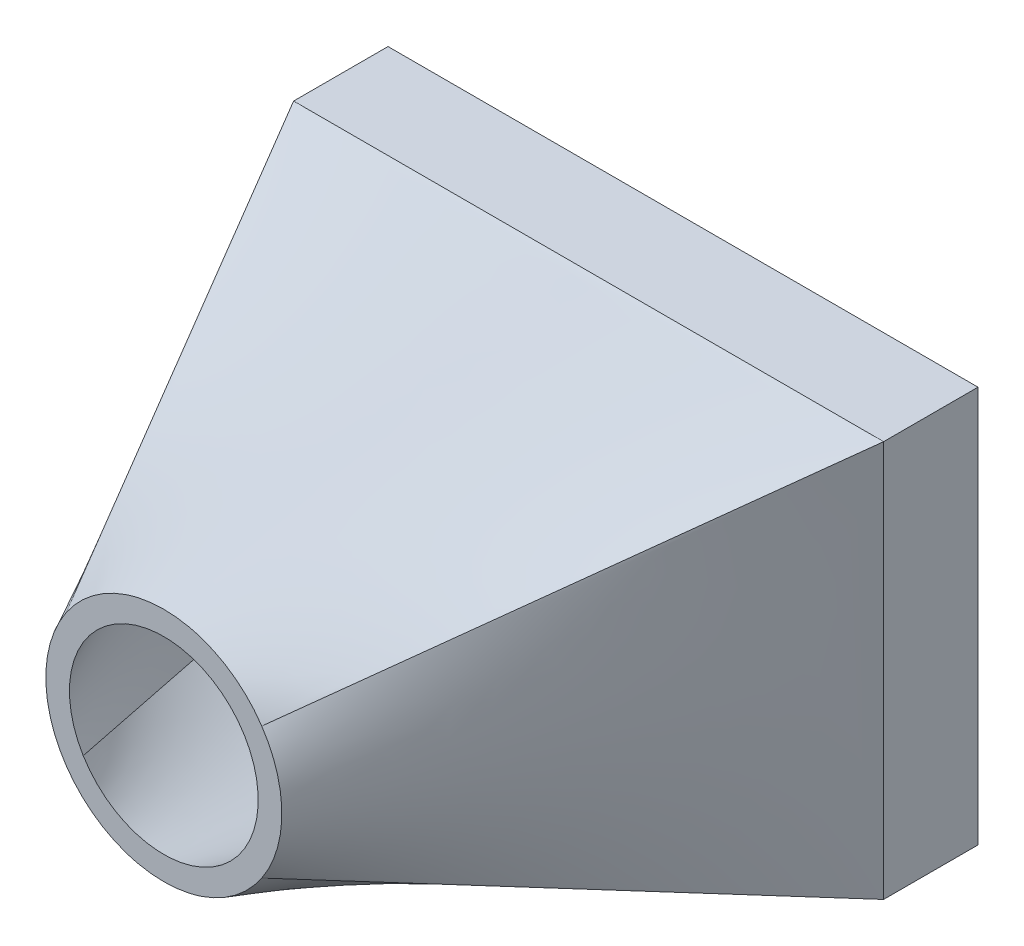
ISO-10303-21;
HEADER;
FILE_DESCRIPTION(('STEP AP214'),'2;1');
FILE_NAME('part.step','',(''),(''),'','','');
FILE_SCHEMA(('AUTOMOTIVE_DESIGN { 1 0 10303 214 1 1 1 1 }'));
ENDSEC;
DATA;
#1=APPLICATION_CONTEXT('core data for automotive mechanical design processes');
#2=APPLICATION_PROTOCOL_DEFINITION('international standard','automotive_design',2000,#1);
#3=PRODUCT_CONTEXT('',#1,'mechanical');
#4=PRODUCT('Part','Part','',(#3));
#5=PRODUCT_RELATED_PRODUCT_CATEGORY('part','',(#4));
#6=PRODUCT_DEFINITION_FORMATION('','',#4);
#7=PRODUCT_DEFINITION_CONTEXT('part definition',#1,'design');
#8=PRODUCT_DEFINITION('design','',#6,#7);
#9=PRODUCT_DEFINITION_SHAPE('','',#8);
#10=(LENGTH_UNIT() NAMED_UNIT(*) SI_UNIT(.MILLI.,.METRE.));
#11=(NAMED_UNIT(*) PLANE_ANGLE_UNIT() SI_UNIT($,.RADIAN.));
#12=(NAMED_UNIT(*) SI_UNIT($,.STERADIAN.) SOLID_ANGLE_UNIT());
#13=UNCERTAINTY_MEASURE_WITH_UNIT(LENGTH_MEASURE(1.E-05),#10,'distance_accuracy_value','');
#14=(GEOMETRIC_REPRESENTATION_CONTEXT(3) GLOBAL_UNCERTAINTY_ASSIGNED_CONTEXT((#13)) GLOBAL_UNIT_ASSIGNED_CONTEXT((#10,
#11,#12)) REPRESENTATION_CONTEXT('',''));
#15=CARTESIAN_POINT('',(0.,0.,0.));
#16=DIRECTION('',(0.,0.,1.));
#17=DIRECTION('',(1.,0.,0.));
#18=AXIS2_PLACEMENT_3D('',#15,#16,#17);
#19=CARTESIAN_POINT('',(-6.25,-4.2,1.));
#20=DIRECTION('',(0.,1.,0.));
#21=DIRECTION('',(0.,0.,1.));
#22=AXIS2_PLACEMENT_3D('',#19,#20,#21);
#23=PLANE('',#22);
#24=DIRECTION('',(0.,0.,-1.));
#25=VECTOR('',#24,1.);
#26=CARTESIAN_POINT('',(-6.25,-4.2,1.));
#27=LINE('',#26,#25);
#28=CARTESIAN_POINT('',(-6.25,-4.2,1.));
#29=VERTEX_POINT('',#28);
#30=CARTESIAN_POINT('',(-6.25,-4.2,-1.));
#31=VERTEX_POINT('',#30);
#32=EDGE_CURVE('E550',#29,#31,#27,.T.);
#33=ORIENTED_EDGE('',*,*,#32,.T.);
#34=DIRECTION('',(-1.,0.,0.));
#35=VECTOR('',#34,1.);
#36=CARTESIAN_POINT('',(6.25,-4.2,-1.));
#37=LINE('',#36,#35);
#38=CARTESIAN_POINT('',(6.25,-4.2,-1.));
#39=VERTEX_POINT('',#38);
#40=EDGE_CURVE('E226',#39,#31,#37,.T.);
#41=ORIENTED_EDGE('',*,*,#40,.F.);
#42=DIRECTION('',(0.,0.,-1.));
#43=VECTOR('',#42,1.);
#44=CARTESIAN_POINT('',(6.25,-4.2,1.));
#45=LINE('',#44,#43);
#46=CARTESIAN_POINT('',(6.25,-4.2,1.));
#47=VERTEX_POINT('',#46);
#48=EDGE_CURVE('E12',#47,#39,#45,.T.);
#49=ORIENTED_EDGE('',*,*,#48,.F.);
#50=DIRECTION('',(1.,0.,0.));
#51=VECTOR('',#50,1.);
#52=CARTESIAN_POINT('',(-6.25,-4.2,1.));
#53=LINE('',#52,#51);
#54=EDGE_CURVE('E295',#29,#47,#53,.T.);
#55=ORIENTED_EDGE('',*,*,#54,.F.);
#56=EDGE_LOOP('',(#33,#41,#49,#55));
#57=FACE_BOUND('',#56,.T.);
#58=ADVANCED_FACE('F97',(#57),#23,.F.);
#59=CARTESIAN_POINT('',(6.25,-4.2,1.));
#60=DIRECTION('',(-1.,0.,0.));
#61=DIRECTION('',(0.,0.,1.));
#62=AXIS2_PLACEMENT_3D('',#59,#60,#61);
#63=PLANE('',#62);
#64=ORIENTED_EDGE('',*,*,#48,.T.);
#65=DIRECTION('',(0.,-1.,0.));
#66=VECTOR('',#65,1.);
#67=CARTESIAN_POINT('',(6.25,4.2,-1.));
#68=LINE('',#67,#66);
#69=CARTESIAN_POINT('',(6.25,4.2,-1.));
#70=VERTEX_POINT('',#69);
#71=EDGE_CURVE('E219',#70,#39,#68,.T.);
#72=ORIENTED_EDGE('',*,*,#71,.F.);
#73=DIRECTION('',(0.,0.,-1.));
#74=VECTOR('',#73,1.);
#75=CARTESIAN_POINT('',(6.25,4.2,1.));
#76=LINE('',#75,#74);
#77=CARTESIAN_POINT('',(6.25,4.2,0.999999999999999));
#78=VERTEX_POINT('',#77);
#79=EDGE_CURVE('E108',#78,#70,#76,.T.);
#80=ORIENTED_EDGE('',*,*,#79,.F.);
#81=DIRECTION('',(0.,1.,0.));
#82=VECTOR('',#81,1.);
#83=CARTESIAN_POINT('',(6.25,-4.2,1.));
#84=LINE('',#83,#82);
#85=EDGE_CURVE('E573',#47,#78,#84,.T.);
#86=ORIENTED_EDGE('',*,*,#85,.F.);
#87=EDGE_LOOP('',(#64,#72,#80,#86));
#88=FACE_BOUND('',#87,.T.);
#89=ADVANCED_FACE('F540',(#88),#63,.F.);
#90=CARTESIAN_POINT('',(-6.25,4.2,1.));
#91=DIRECTION('',(0.,-1.,0.));
#92=DIRECTION('',(0.,0.,-1.));
#93=AXIS2_PLACEMENT_3D('',#90,#91,#92);
#94=PLANE('',#93);
#95=ORIENTED_EDGE('',*,*,#79,.T.);
#96=DIRECTION('',(1.,0.,0.));
#97=VECTOR('',#96,1.);
#98=CARTESIAN_POINT('',(-6.25,4.2,-1.));
#99=LINE('',#98,#97);
#100=CARTESIAN_POINT('',(-6.25,4.2,-1.));
#101=VERTEX_POINT('',#100);
#102=EDGE_CURVE('E234',#101,#70,#99,.T.);
#103=ORIENTED_EDGE('',*,*,#102,.F.);
#104=DIRECTION('',(0.,0.,-1.));
#105=VECTOR('',#104,1.);
#106=CARTESIAN_POINT('',(-6.25,4.2,1.));
#107=LINE('',#106,#105);
#108=CARTESIAN_POINT('',(-6.25,4.2,1.));
#109=VERTEX_POINT('',#108);
#110=EDGE_CURVE('E558',#109,#101,#107,.T.);
#111=ORIENTED_EDGE('',*,*,#110,.F.);
#112=DIRECTION('',(1.,0.,0.));
#113=VECTOR('',#112,1.);
#114=CARTESIAN_POINT('',(-6.25,4.2,1.));
#115=LINE('',#114,#113);
#116=EDGE_CURVE('E576',#78,#109,#115,.F.);
#117=ORIENTED_EDGE('',*,*,#116,.F.);
#118=EDGE_LOOP('',(#95,#103,#111,#117));
#119=FACE_BOUND('',#118,.T.);
#120=ADVANCED_FACE('F546',(#119),#94,.F.);
#121=CARTESIAN_POINT('',(-6.25,-4.2,1.));
#122=DIRECTION('',(1.,0.,0.));
#123=DIRECTION('',(0.,0.,-1.));
#124=AXIS2_PLACEMENT_3D('',#121,#122,#123);
#125=PLANE('',#124);
#126=ORIENTED_EDGE('',*,*,#110,.T.);
#127=DIRECTION('',(0.,1.,0.));
#128=VECTOR('',#127,1.);
#129=CARTESIAN_POINT('',(-6.25,-4.2,-1.));
#130=LINE('',#129,#128);
#131=EDGE_CURVE('E230',#31,#101,#130,.T.);
#132=ORIENTED_EDGE('',*,*,#131,.F.);
#133=ORIENTED_EDGE('',*,*,#32,.F.);
#134=DIRECTION('',(0.,1.,0.));
#135=VECTOR('',#134,1.);
#136=CARTESIAN_POINT('',(-6.25,-4.2,1.));
#137=LINE('',#136,#135);
#138=EDGE_CURVE('E559',#109,#29,#137,.F.);
#139=ORIENTED_EDGE('',*,*,#138,.F.);
#140=EDGE_LOOP('',(#126,#132,#133,#139));
#141=FACE_BOUND('',#140,.T.);
#142=ADVANCED_FACE('F562',(#141),#125,.F.);
#143=CARTESIAN_POINT('',(5.25,-3.2,1.));
#144=DIRECTION('',(-1.,0.,0.));
#145=DIRECTION('',(0.,0.,1.));
#146=AXIS2_PLACEMENT_3D('',#143,#144,#145);
#147=PLANE('',#146);
#148=DIRECTION('',(0.,0.,-1.));
#149=VECTOR('',#148,1.);
#150=CARTESIAN_POINT('',(5.25,3.2,1.));
#151=LINE('',#150,#149);
#152=CARTESIAN_POINT('',(5.25,3.2,1.));
#153=VERTEX_POINT('',#152);
#154=CARTESIAN_POINT('',(5.25,3.2,-1.));
#155=VERTEX_POINT('',#154);
#156=EDGE_CURVE('E287',#153,#155,#151,.T.);
#157=ORIENTED_EDGE('',*,*,#156,.T.);
#158=DIRECTION('',(0.,-1.,0.));
#159=VECTOR('',#158,1.);
#160=CARTESIAN_POINT('',(5.25,3.2,-1.));
#161=LINE('',#160,#159);
#162=CARTESIAN_POINT('',(5.25,-3.2,-1.));
#163=VERTEX_POINT('',#162);
#164=EDGE_CURVE('E210',#155,#163,#161,.T.);
#165=ORIENTED_EDGE('',*,*,#164,.T.);
#166=DIRECTION('',(0.,0.,-1.));
#167=VECTOR('',#166,1.);
#168=CARTESIAN_POINT('',(5.25,-3.2,1.));
#169=LINE('',#168,#167);
#170=CARTESIAN_POINT('',(5.25,-3.2,1.));
#171=VERTEX_POINT('',#170);
#172=EDGE_CURVE('E116',#171,#163,#169,.T.);
#173=ORIENTED_EDGE('',*,*,#172,.F.);
#174=CARTESIAN_POINT('',(5.25,3.2,1.));
#175=CARTESIAN_POINT('',(5.25,2.66666666666667,1.));
#176=CARTESIAN_POINT('',(5.25,2.13333333333333,1.));
#177=CARTESIAN_POINT('',(5.25,1.06666666666667,1.));
#178=CARTESIAN_POINT('',(5.25,0.533333333333335,1.));
#179=CARTESIAN_POINT('',(5.25,-0.533333333333332,1.));
#180=CARTESIAN_POINT('',(5.25,-1.06666666666666,1.));
#181=CARTESIAN_POINT('',(5.25,-2.13333333333333,1.));
#182=CARTESIAN_POINT('',(5.25,-2.66666666666667,1.));
#183=CARTESIAN_POINT('',(5.25,-3.2,1.));
#184=B_SPLINE_CURVE_WITH_KNOTS('',3,(#174,#175,#176,#177,#178,#179,#180,#181,#182,#183),
.UNSPECIFIED.,.F.,.F.,(4,2,2,2,4),(0.,0.25,0.5,0.75,1.),.UNSPECIFIED.);
#185=EDGE_CURVE('E302',#171,#153,#184,.F.);
#186=ORIENTED_EDGE('',*,*,#185,.T.);
#187=EDGE_LOOP('',(#157,#165,#173,#186));
#188=FACE_BOUND('',#187,.T.);
#189=ADVANCED_FACE('F277',(#188),#147,.T.);
#190=CARTESIAN_POINT('',(-5.25,3.2,1.));
#191=DIRECTION('',(0.,-1.,0.));
#192=DIRECTION('',(0.,0.,-1.));
#193=AXIS2_PLACEMENT_3D('',#190,#191,#192);
#194=PLANE('',#193);
#195=DIRECTION('',(0.,0.,-1.));
#196=VECTOR('',#195,1.);
#197=CARTESIAN_POINT('',(-5.25,3.2,1.));
#198=LINE('',#197,#196);
#199=CARTESIAN_POINT('',(-5.25,3.2,1.));
#200=VERTEX_POINT('',#199);
#201=CARTESIAN_POINT('',(-5.25,3.2,-1.));
#202=VERTEX_POINT('',#201);
#203=EDGE_CURVE('E202',#200,#202,#198,.T.);
#204=ORIENTED_EDGE('',*,*,#203,.T.);
#205=DIRECTION('',(1.,0.,0.));
#206=VECTOR('',#205,1.);
#207=CARTESIAN_POINT('',(-5.25,3.2,-1.));
#208=LINE('',#207,#206);
#209=EDGE_CURVE('E215',#202,#155,#208,.T.);
#210=ORIENTED_EDGE('',*,*,#209,.T.);
#211=ORIENTED_EDGE('',*,*,#156,.F.);
#212=CARTESIAN_POINT('',(-5.25,3.2,1.));
#213=CARTESIAN_POINT('',(-4.8125,3.2,1.));
#214=CARTESIAN_POINT('',(-4.375,3.2,1.));
#215=CARTESIAN_POINT('',(-3.5,3.2,1.));
#216=CARTESIAN_POINT('',(-3.0625,3.2,1.));
#217=CARTESIAN_POINT('',(-2.1875,3.2,1.));
#218=CARTESIAN_POINT('',(-1.75,3.2,1.));
#219=CARTESIAN_POINT('',(-0.874999999999995,3.2,1.));
#220=CARTESIAN_POINT('',(-0.437499999999995,3.2,1.));
#221=CARTESIAN_POINT('',(0.437500000000005,3.2,1.));
#222=CARTESIAN_POINT('',(0.875000000000004,3.2,1.));
#223=CARTESIAN_POINT('',(1.75,3.2,1.));
#224=CARTESIAN_POINT('',(2.1875,3.2,1.));
#225=CARTESIAN_POINT('',(3.0625,3.2,1.));
#226=CARTESIAN_POINT('',(3.5,3.2,1.));
#227=CARTESIAN_POINT('',(4.375,3.2,1.));
#228=CARTESIAN_POINT('',(4.8125,3.2,1.));
#229=CARTESIAN_POINT('',(5.25,3.2,1.));
#230=B_SPLINE_CURVE_WITH_KNOTS('',3,(#212,#213,#214,#215,#216,#217,#218,#219,#220,#221,#222,
#223,#224,#225,#226,#227,#228,#229),.UNSPECIFIED.,.F.,.F.,(4,2,2,2,2,2,2,2,4),(0.,0.125,0.25,
0.375,0.5,0.625,0.75,0.875,1.),.UNSPECIFIED.);
#231=EDGE_CURVE('E322',#153,#200,#230,.F.);
#232=ORIENTED_EDGE('',*,*,#231,.T.);
#233=EDGE_LOOP('',(#204,#210,#211,#232));
#234=FACE_BOUND('',#233,.T.);
#235=ADVANCED_FACE('F271',(#234),#194,.T.);
#236=CARTESIAN_POINT('',(-5.25,-3.2,1.));
#237=DIRECTION('',(1.,0.,0.));
#238=DIRECTION('',(0.,0.,-1.));
#239=AXIS2_PLACEMENT_3D('',#236,#237,#238);
#240=PLANE('',#239);
#241=DIRECTION('',(0.,0.,-1.));
#242=VECTOR('',#241,1.);
#243=CARTESIAN_POINT('',(-5.25,-3.2,1.));
#244=LINE('',#243,#242);
#245=CARTESIAN_POINT('',(-5.25,-3.2,1.));
#246=VERTEX_POINT('',#245);
#247=CARTESIAN_POINT('',(-5.25,-3.2,-1.));
#248=VERTEX_POINT('',#247);
#249=EDGE_CURVE('E193',#246,#248,#244,.T.);
#250=ORIENTED_EDGE('',*,*,#249,.T.);
#251=DIRECTION('',(0.,1.,0.));
#252=VECTOR('',#251,1.);
#253=CARTESIAN_POINT('',(-5.25,-3.2,-1.));
#254=LINE('',#253,#252);
#255=EDGE_CURVE('E197',#248,#202,#254,.T.);
#256=ORIENTED_EDGE('',*,*,#255,.T.);
#257=ORIENTED_EDGE('',*,*,#203,.F.);
#258=CARTESIAN_POINT('',(-5.25,-3.2,1.));
#259=CARTESIAN_POINT('',(-5.25,-2.66666666666667,1.));
#260=CARTESIAN_POINT('',(-5.25,-2.13333333333334,1.));
#261=CARTESIAN_POINT('',(-5.25,-1.06666666666668,1.));
#262=CARTESIAN_POINT('',(-5.25,-0.533333333333351,1.));
#263=CARTESIAN_POINT('',(-5.25,0.533333333333316,1.));
#264=CARTESIAN_POINT('',(-5.25,1.06666666666665,1.));
#265=CARTESIAN_POINT('',(-5.25,2.13333333333332,1.));
#266=CARTESIAN_POINT('',(-5.25,2.66666666666666,1.));
#267=CARTESIAN_POINT('',(-5.25,3.2,1.));
#268=B_SPLINE_CURVE_WITH_KNOTS('',3,(#258,#259,#260,#261,#262,#263,#264,#265,#266,#267),
.UNSPECIFIED.,.F.,.F.,(4,2,2,2,4),(0.,0.25,0.5,0.75,1.),.UNSPECIFIED.);
#269=EDGE_CURVE('E199',#200,#246,#268,.F.);
#270=ORIENTED_EDGE('',*,*,#269,.T.);
#271=EDGE_LOOP('',(#250,#256,#257,#270));
#272=FACE_BOUND('',#271,.T.);
#273=ADVANCED_FACE('F194',(#272),#240,.T.);
#274=CARTESIAN_POINT('',(-5.25,-3.2,1.));
#275=DIRECTION('',(0.,1.,0.));
#276=DIRECTION('',(0.,0.,1.));
#277=AXIS2_PLACEMENT_3D('',#274,#275,#276);
#278=PLANE('',#277);
#279=ORIENTED_EDGE('',*,*,#172,.T.);
#280=DIRECTION('',(-1.,0.,0.));
#281=VECTOR('',#280,1.);
#282=CARTESIAN_POINT('',(5.25,-3.2,-1.));
#283=LINE('',#282,#281);
#284=EDGE_CURVE('E205',#163,#248,#283,.T.);
#285=ORIENTED_EDGE('',*,*,#284,.T.);
#286=ORIENTED_EDGE('',*,*,#249,.F.);
#287=CARTESIAN_POINT('',(5.25,-3.2,1.));
#288=CARTESIAN_POINT('',(4.8125,-3.2,1.));
#289=CARTESIAN_POINT('',(4.375,-3.2,1.));
#290=CARTESIAN_POINT('',(3.5,-3.2,1.));
#291=CARTESIAN_POINT('',(3.0625,-3.2,1.));
#292=CARTESIAN_POINT('',(2.1875,-3.2,1.));
#293=CARTESIAN_POINT('',(1.75,-3.2,1.));
#294=CARTESIAN_POINT('',(0.875000000000002,-3.2,1.));
#295=CARTESIAN_POINT('',(0.437500000000001,-3.2,1.));
#296=CARTESIAN_POINT('',(-0.437499999999999,-3.2,1.));
#297=CARTESIAN_POINT('',(-0.874999999999998,-3.2,1.));
#298=CARTESIAN_POINT('',(-1.75,-3.2,1.));
#299=CARTESIAN_POINT('',(-2.1875,-3.2,1.));
#300=CARTESIAN_POINT('',(-3.0625,-3.2,1.));
#301=CARTESIAN_POINT('',(-3.5,-3.2,1.));
#302=CARTESIAN_POINT('',(-4.375,-3.2,1.));
#303=CARTESIAN_POINT('',(-4.8125,-3.2,1.));
#304=CARTESIAN_POINT('',(-5.25,-3.2,1.));
#305=B_SPLINE_CURVE_WITH_KNOTS('',3,(#287,#288,#289,#290,#291,#292,#293,#294,#295,#296,#297,
#298,#299,#300,#301,#302,#303,#304),.UNSPECIFIED.,.F.,.F.,(4,2,2,2,2,2,2,2,4),(0.,0.125,0.25,
0.375,0.5,0.625,0.75,0.875,1.),.UNSPECIFIED.);
#306=EDGE_CURVE('E314',#246,#171,#305,.F.);
#307=ORIENTED_EDGE('',*,*,#306,.T.);
#308=EDGE_LOOP('',(#279,#285,#286,#307));
#309=FACE_BOUND('',#308,.T.);
#310=ADVANCED_FACE('F206',(#309),#278,.T.);
#311=CARTESIAN_POINT('',(0.,0.,10.));
#312=DIRECTION('',(0.,0.,1.));
#313=DIRECTION('',(1.,0.,0.));
#314=AXIS2_PLACEMENT_3D('',#311,#312,#313);
#315=PLANE('',#314);
#316=CARTESIAN_POINT('',(0.,0.,10.));
#317=DIRECTION('',(0.,0.,1.));
#318=DIRECTION('',(1.,0.,0.));
#319=AXIS2_PLACEMENT_3D('',#316,#317,#318);
#320=CIRCLE('',#319,2.);
#321=CARTESIAN_POINT('',(-1.70776865476249,-1.04092565623618,10.));
#322=VERTEX_POINT('',#321);
#323=CARTESIAN_POINT('',(1.70776865476249,-1.04092565623618,10.));
#324=VERTEX_POINT('',#323);
#325=EDGE_CURVE('E251',#322,#324,#320,.T.);
#326=ORIENTED_EDGE('',*,*,#325,.F.);
#327=CARTESIAN_POINT('',(-1.70776865476249,1.04092565623618,10.));
#328=VERTEX_POINT('',#327);
#329=EDGE_CURVE('E249',#328,#322,#320,.T.);
#330=ORIENTED_EDGE('',*,*,#329,.F.);
#331=CARTESIAN_POINT('',(1.70776865476249,1.04092565623618,10.));
#332=VERTEX_POINT('',#331);
#333=EDGE_CURVE('E238',#332,#328,#320,.T.);
#334=ORIENTED_EDGE('',*,*,#333,.F.);
#335=EDGE_CURVE('E253',#324,#332,#320,.T.);
#336=ORIENTED_EDGE('',*,*,#335,.F.);
#337=EDGE_LOOP('',(#326,#330,#334,#336));
#338=FACE_BOUND('',#337,.T.);
#339=CARTESIAN_POINT('',(0.,0.,10.));
#340=DIRECTION('',(0.,0.,1.));
#341=DIRECTION('',(1.,0.,0.));
#342=AXIS2_PLACEMENT_3D('',#339,#340,#341);
#343=CIRCLE('',#342,2.5);
#344=CARTESIAN_POINT('',(2.07500392425113,1.39440263709676,10.));
#345=VERTEX_POINT('',#344);
#346=CARTESIAN_POINT('',(-2.07500392425113,1.39440263709676,10.));
#347=VERTEX_POINT('',#346);
#348=EDGE_CURVE('E329',#345,#347,#343,.T.);
#349=ORIENTED_EDGE('',*,*,#348,.T.);
#350=CARTESIAN_POINT('',(-2.07500392425113,-1.39440263709676,10.));
#351=VERTEX_POINT('',#350);
#352=EDGE_CURVE('E331',#347,#351,#343,.T.);
#353=ORIENTED_EDGE('',*,*,#352,.T.);
#354=CARTESIAN_POINT('',(2.07500392425113,-1.39440263709676,10.));
#355=VERTEX_POINT('',#354);
#356=EDGE_CURVE('E334',#351,#355,#343,.T.);
#357=ORIENTED_EDGE('',*,*,#356,.T.);
#358=EDGE_CURVE('E337',#355,#345,#343,.T.);
#359=ORIENTED_EDGE('',*,*,#358,.T.);
#360=EDGE_LOOP('',(#349,#353,#357,#359));
#361=FACE_BOUND('',#360,.T.);
#362=ADVANCED_FACE('F379',(#338,#361),#315,.T.);
#363=CARTESIAN_POINT('',(-6.25,4.2,1.));
#364=CARTESIAN_POINT('',(-2.07500392425113,1.39440263709676,10.));
#365=CARTESIAN_POINT('',(-6.25,3.5,1.));
#366=CARTESIAN_POINT('',(-2.20462783854063,1.2015099074993,10.));
#367=CARTESIAN_POINT('',(-6.25,2.8,1.));
#368=CARTESIAN_POINT('',(-2.31257792315013,0.981630687979022,10.));
#369=CARTESIAN_POINT('',(-6.25,1.4,1.));
#370=CARTESIAN_POINT('',(-2.46045502288664,0.507716986691863,10.));
#371=CARTESIAN_POINT('',(-6.25,0.699999999999998,1.));
#372=CARTESIAN_POINT('',(-2.5,0.253989333521903,10.));
#373=CARTESIAN_POINT('',(-6.25,-0.700000000000002,1.));
#374=CARTESIAN_POINT('',(-2.5,-0.253989333521902,10.));
#375=CARTESIAN_POINT('',(-6.25,-1.4,1.));
#376=CARTESIAN_POINT('',(-2.46045502288664,-0.507716986691863,10.));
#377=CARTESIAN_POINT('',(-6.25,-2.8,1.));
#378=CARTESIAN_POINT('',(-2.31257792315013,-0.981630687979021,10.));
#379=CARTESIAN_POINT('',(-6.25,-3.5,1.));
#380=CARTESIAN_POINT('',(-2.20462783854063,-1.2015099074993,10.));
#381=CARTESIAN_POINT('',(-6.25,-4.2,1.));
#382=CARTESIAN_POINT('',(-2.07500392425113,-1.39440263709676,10.));
#383=B_SPLINE_SURFACE_WITH_KNOTS('',3,1,((#363,#364),(#365,#366),(#367,#368),(#369,#370),(#371,
#372),(#373,#374),(#375,#376),(#377,#378),(#379,#380),(#381,#382)),.UNSPECIFIED.,.F.,.F.,.F.,(4,
2,2,2,4),(2,2),(0.,0.25,0.5,0.75,1.),(0.,1.),.UNSPECIFIED.);
#384=DIRECTION('',(0.404935094672259,0.272116383619758,0.872914797026877));
#385=VECTOR('',#384,1.);
#386=CARTESIAN_POINT('',(-4.16250196212557,-2.79720131854838,5.5));
#387=LINE('',#386,#385);
#388=EDGE_CURVE('E348',#29,#351,#387,.T.);
#389=DIRECTION('',(-0.404935094672259,0.272116383619758,-0.872914797026877));
#390=VECTOR('',#389,1.);
#391=CARTESIAN_POINT('',(-4.16250196212557,2.79720131854838,5.5));
#392=LINE('',#391,#390);
#393=EDGE_CURVE('E352',#347,#109,#392,.T.);
#394=ORIENTED_EDGE('',*,*,#138,.T.);
#395=ORIENTED_EDGE('',*,*,#388,.T.);
#396=ORIENTED_EDGE('',*,*,#352,.F.);
#397=ORIENTED_EDGE('',*,*,#393,.T.);
#398=EDGE_LOOP('',(#394,#395,#396,#397));
#399=FACE_BOUND('',#398,.T.);
#400=ADVANCED_FACE('F399',(#399),#383,.T.);
#401=CARTESIAN_POINT('',(-6.25,-4.2,1.));
#402=CARTESIAN_POINT('',(-2.07500392425113,-1.39440263709676,10.));
#403=CARTESIAN_POINT('',(-5.72916666666667,-4.2,1.));
#404=CARTESIAN_POINT('',(-1.9785575594524,-1.53792401328535,10.));
#405=CARTESIAN_POINT('',(-5.20833333333333,-4.2,1.));
#406=CARTESIAN_POINT('',(-1.86164323960616,-1.67956315420566,10.));
#407=CARTESIAN_POINT('',(-4.16666666666666,-4.2,1.));
#408=CARTESIAN_POINT('',(-1.58421408968886,-1.94342832606914,10.));
#409=CARTESIAN_POINT('',(-3.64583333333333,-4.2,1.));
#410=CARTESIAN_POINT('',(-1.42358774096064,-2.06551906767005,10.));
#411=CARTESIAN_POINT('',(-2.60416666666666,-4.2,1.));
#412=CARTESIAN_POINT('',(-1.06394815175803,-2.27178022825551,10.));
#413=CARTESIAN_POINT('',(-2.08333333333333,-4.2,1.));
#414=CARTESIAN_POINT('',(-0.864940413432553,-2.35572953861995,10.));
#415=CARTESIAN_POINT('',(-1.04166666666666,-4.2,1.));
#416=CARTESIAN_POINT('',(-0.443879209340652,-2.46993012561703,10.));
#417=CARTESIAN_POINT('',(-0.520833333333327,-4.2,1.));
#418=CARTESIAN_POINT('',(-0.222007082730027,-2.5,10.));
#419=CARTESIAN_POINT('',(0.520833333333339,-4.2,1.));
#420=CARTESIAN_POINT('',(0.222007082730025,-2.5,10.));
#421=CARTESIAN_POINT('',(1.04166666666667,-4.2,1.));
#422=CARTESIAN_POINT('',(0.44387920934065,-2.46993012561703,10.));
#423=CARTESIAN_POINT('',(2.08333333333334,-4.2,1.));
#424=CARTESIAN_POINT('',(0.864940413432551,-2.35572953861995,10.));
#425=CARTESIAN_POINT('',(2.60416666666667,-4.2,1.));
#426=CARTESIAN_POINT('',(1.06394815175803,-2.27178022825551,10.));
#427=CARTESIAN_POINT('',(3.64583333333334,-4.2,1.));
#428=CARTESIAN_POINT('',(1.42358774096064,-2.06551906767005,10.));
#429=CARTESIAN_POINT('',(4.16666666666667,-4.2,1.));
#430=CARTESIAN_POINT('',(1.58421408968886,-1.94342832606914,10.));
#431=CARTESIAN_POINT('',(5.20833333333333,-4.2,1.));
#432=CARTESIAN_POINT('',(1.86164323960616,-1.67956315420567,10.));
#433=CARTESIAN_POINT('',(5.72916666666667,-4.2,1.));
#434=CARTESIAN_POINT('',(1.9785575594524,-1.53792401328535,10.));
#435=CARTESIAN_POINT('',(6.25,-4.2,1.));
#436=CARTESIAN_POINT('',(2.07500392425113,-1.39440263709676,10.));
#437=B_SPLINE_SURFACE_WITH_KNOTS('',3,1,((#401,#402),(#403,#404),(#405,#406),(#407,#408),(#409,
#410),(#411,#412),(#413,#414),(#415,#416),(#417,#418),(#419,#420),(#421,#422),(#423,#424),(#425,
#426),(#427,#428),(#429,#430),(#431,#432),(#433,#434),(#435,#436)),.UNSPECIFIED.,.F.,.F.,.F.,(4,
2,2,2,2,2,2,2,4),(2,2),(0.,0.125,0.25,0.375,0.5,0.625,0.75,0.875,1.),(0.,1.),.UNSPECIFIED.);
#438=DIRECTION('',(-0.404935094672259,0.272116383619758,0.872914797026877));
#439=VECTOR('',#438,1.);
#440=CARTESIAN_POINT('',(4.16250196212557,-2.79720131854838,5.5));
#441=LINE('',#440,#439);
#442=EDGE_CURVE('E344',#47,#355,#441,.T.);
#443=ORIENTED_EDGE('',*,*,#54,.T.);
#444=ORIENTED_EDGE('',*,*,#442,.T.);
#445=ORIENTED_EDGE('',*,*,#356,.F.);
#446=ORIENTED_EDGE('',*,*,#388,.F.);
#447=EDGE_LOOP('',(#443,#444,#445,#446));
#448=FACE_BOUND('',#447,.T.);
#449=ADVANCED_FACE('F607',(#448),#437,.T.);
#450=CARTESIAN_POINT('',(6.25,4.2,1.));
#451=CARTESIAN_POINT('',(2.07500392425113,1.39440263709676,10.));
#452=CARTESIAN_POINT('',(5.72916666666666,4.2,1.));
#453=CARTESIAN_POINT('',(1.9785575594524,1.53792401328535,10.));
#454=CARTESIAN_POINT('',(5.20833333333333,4.2,1.));
#455=CARTESIAN_POINT('',(1.86164323960616,1.67956315420567,10.));
#456=CARTESIAN_POINT('',(4.16666666666666,4.2,1.));
#457=CARTESIAN_POINT('',(1.58421408968886,1.94342832606914,10.));
#458=CARTESIAN_POINT('',(3.64583333333333,4.2,1.));
#459=CARTESIAN_POINT('',(1.42358774096064,2.06551906767005,10.));
#460=CARTESIAN_POINT('',(2.60416666666666,4.2,1.));
#461=CARTESIAN_POINT('',(1.06394815175803,2.27178022825551,10.));
#462=CARTESIAN_POINT('',(2.08333333333332,4.2,1.));
#463=CARTESIAN_POINT('',(0.864940413432553,2.35572953861995,10.));
#464=CARTESIAN_POINT('',(1.04166666666666,4.2,1.));
#465=CARTESIAN_POINT('',(0.443879209340652,2.46993012561703,10.));
#466=CARTESIAN_POINT('',(0.520833333333323,4.2,1.));
#467=CARTESIAN_POINT('',(0.222007082730026,2.5,10.));
#468=CARTESIAN_POINT('',(-0.520833333333344,4.2,1.));
#469=CARTESIAN_POINT('',(-0.222007082730026,2.5,10.));
#470=CARTESIAN_POINT('',(-1.04166666666668,4.2,1.));
#471=CARTESIAN_POINT('',(-0.443879209340651,2.46993012561703,10.));
#472=CARTESIAN_POINT('',(-2.08333333333334,4.2,1.));
#473=CARTESIAN_POINT('',(-0.864940413432553,2.35572953861995,10.));
#474=CARTESIAN_POINT('',(-2.60416666666668,4.2,1.));
#475=CARTESIAN_POINT('',(-1.06394815175803,2.27178022825551,10.));
#476=CARTESIAN_POINT('',(-3.64583333333334,4.2,1.));
#477=CARTESIAN_POINT('',(-1.42358774096064,2.06551906767005,10.));
#478=CARTESIAN_POINT('',(-4.16666666666667,4.2,1.));
#479=CARTESIAN_POINT('',(-1.58421408968886,1.94342832606914,10.));
#480=CARTESIAN_POINT('',(-5.20833333333334,4.2,1.));
#481=CARTESIAN_POINT('',(-1.86164323960616,1.67956315420567,10.));
#482=CARTESIAN_POINT('',(-5.72916666666667,4.2,1.));
#483=CARTESIAN_POINT('',(-1.9785575594524,1.53792401328535,10.));
#484=CARTESIAN_POINT('',(-6.25,4.2,1.));
#485=CARTESIAN_POINT('',(-2.07500392425113,1.39440263709676,10.));
#486=B_SPLINE_SURFACE_WITH_KNOTS('',3,1,((#450,#451),(#452,#453),(#454,#455),(#456,#457),(#458,
#459),(#460,#461),(#462,#463),(#464,#465),(#466,#467),(#468,#469),(#470,#471),(#472,#473),(#474,
#475),(#476,#477),(#478,#479),(#480,#481),(#482,#483),(#484,#485)),.UNSPECIFIED.,.F.,.F.,.F.,(4,
2,2,2,2,2,2,2,4),(2,2),(0.,0.125,0.25,0.375,0.5,0.625,0.75,0.875,1.),(0.,1.),.UNSPECIFIED.);
#487=DIRECTION('',(-0.404935094672259,-0.272116383619758,0.872914797026877));
#488=VECTOR('',#487,1.);
#489=CARTESIAN_POINT('',(4.16250196212557,2.79720131854838,5.5));
#490=LINE('',#489,#488);
#491=EDGE_CURVE('E341',#78,#345,#490,.T.);
#492=ORIENTED_EDGE('',*,*,#116,.T.);
#493=ORIENTED_EDGE('',*,*,#393,.F.);
#494=ORIENTED_EDGE('',*,*,#348,.F.);
#495=ORIENTED_EDGE('',*,*,#491,.F.);
#496=EDGE_LOOP('',(#492,#493,#494,#495));
#497=FACE_BOUND('',#496,.T.);
#498=ADVANCED_FACE('F586',(#497),#486,.T.);
#499=CARTESIAN_POINT('',(6.25,-4.2,1.));
#500=CARTESIAN_POINT('',(2.07500392425113,-1.39440263709676,10.));
#501=CARTESIAN_POINT('',(6.25,-3.5,1.));
#502=CARTESIAN_POINT('',(2.20462783854062,-1.2015099074993,10.));
#503=CARTESIAN_POINT('',(6.25,-2.8,1.));
#504=CARTESIAN_POINT('',(2.31257792315013,-0.981630687979023,10.));
#505=CARTESIAN_POINT('',(6.25,-1.39999999999999,1.));
#506=CARTESIAN_POINT('',(2.46045502288664,-0.507716986691864,10.));
#507=CARTESIAN_POINT('',(6.25,-0.699999999999993,1.));
#508=CARTESIAN_POINT('',(2.5,-0.253989333521903,10.));
#509=CARTESIAN_POINT('',(6.25,0.700000000000007,1.));
#510=CARTESIAN_POINT('',(2.5,0.253989333521902,10.));
#511=CARTESIAN_POINT('',(6.25,1.40000000000001,1.));
#512=CARTESIAN_POINT('',(2.46045502288664,0.507716986691863,10.));
#513=CARTESIAN_POINT('',(6.25,2.8,1.));
#514=CARTESIAN_POINT('',(2.31257792315013,0.981630687979023,10.));
#515=CARTESIAN_POINT('',(6.25,3.5,1.));
#516=CARTESIAN_POINT('',(2.20462783854063,1.2015099074993,10.));
#517=CARTESIAN_POINT('',(6.25,4.2,1.));
#518=CARTESIAN_POINT('',(2.07500392425113,1.39440263709676,10.));
#519=B_SPLINE_SURFACE_WITH_KNOTS('',3,1,((#499,#500),(#501,#502),(#503,#504),(#505,#506),(#507,
#508),(#509,#510),(#511,#512),(#513,#514),(#515,#516),(#517,#518)),.UNSPECIFIED.,.F.,.F.,.F.,(4,
2,2,2,4),(2,2),(0.,0.25,0.5,0.75,1.),(0.,1.),.UNSPECIFIED.);
#520=ORIENTED_EDGE('',*,*,#85,.T.);
#521=ORIENTED_EDGE('',*,*,#491,.T.);
#522=ORIENTED_EDGE('',*,*,#358,.F.);
#523=ORIENTED_EDGE('',*,*,#442,.F.);
#524=EDGE_LOOP('',(#520,#521,#522,#523));
#525=FACE_BOUND('',#524,.T.);
#526=ADVANCED_FACE('F400',(#525),#519,.T.);
#527=CARTESIAN_POINT('',(1.70776865476249,-1.04092565623618,10.));
#528=CARTESIAN_POINT('',(5.25,-3.2,1.));
#529=CARTESIAN_POINT('',(1.63369947944339,-1.16244539699407,10.));
#530=CARTESIAN_POINT('',(4.8125,-3.2,1.));
#531=CARTESIAN_POINT('',(1.54200887562624,-1.28354475003521,10.));
#532=CARTESIAN_POINT('',(4.375,-3.2,1.));
#533=CARTESIAN_POINT('',(1.31984948990967,-1.51105123071265,10.));
#534=CARTESIAN_POINT('',(3.5,-3.2,1.));
#535=CARTESIAN_POINT('',(1.18925611135401,-1.6173367152245,10.));
#536=CARTESIAN_POINT('',(3.0625,-3.2,1.));
#537=CARTESIAN_POINT('',(0.892947871945789,-1.79798560806073,10.));
#538=CARTESIAN_POINT('',(2.1875,-3.2,1.));
#539=CARTESIAN_POINT('',(0.727221120097388,-1.87212470991405,10.));
#540=CARTESIAN_POINT('',(1.75,-3.2,1.));
#541=CARTESIAN_POINT('',(0.374256765069914,-1.97322917087344,10.));
#542=CARTESIAN_POINT('',(0.875000000000002,-3.2,1.));
#543=CARTESIAN_POINT('',(0.187198334522502,-2.,10.));
#544=CARTESIAN_POINT('',(0.437500000000001,-3.2,1.));
#545=CARTESIAN_POINT('',(-0.187198334522503,-2.,10.));
#546=CARTESIAN_POINT('',(-0.437499999999999,-3.2,1.));
#547=CARTESIAN_POINT('',(-0.374256765069916,-1.97322917087344,10.));
#548=CARTESIAN_POINT('',(-0.874999999999998,-3.2,1.));
#549=CARTESIAN_POINT('',(-0.727221120097389,-1.87212470991405,10.));
#550=CARTESIAN_POINT('',(-1.75,-3.2,1.));
#551=CARTESIAN_POINT('',(-0.892947871945791,-1.79798560806073,10.));
#552=CARTESIAN_POINT('',(-2.1875,-3.2,1.));
#553=CARTESIAN_POINT('',(-1.18925611135401,-1.6173367152245,10.));
#554=CARTESIAN_POINT('',(-3.0625,-3.2,1.));
#555=CARTESIAN_POINT('',(-1.31984948990967,-1.51105123071265,10.));
#556=CARTESIAN_POINT('',(-3.5,-3.2,1.));
#557=CARTESIAN_POINT('',(-1.54200887562624,-1.28354475003521,10.));
#558=CARTESIAN_POINT('',(-4.375,-3.2,1.));
#559=CARTESIAN_POINT('',(-1.63369947944339,-1.16244539699407,10.));
#560=CARTESIAN_POINT('',(-4.8125,-3.2,1.));
#561=CARTESIAN_POINT('',(-1.70776865476249,-1.04092565623618,10.));
#562=CARTESIAN_POINT('',(-5.25,-3.2,1.));
#563=B_SPLINE_SURFACE_WITH_KNOTS('',3,1,((#527,#528),(#529,#530),(#531,#532),(#533,#534),(#535,
#536),(#537,#538),(#539,#540),(#541,#542),(#543,#544),(#545,#546),(#547,#548),(#549,#550),(#551,
#552),(#553,#554),(#555,#556),(#557,#558),(#559,#560),(#561,#562)),.UNSPECIFIED.,.F.,.F.,.F.,(4,
2,2,2,2,2,2,2,4),(2,2),(0.,0.125,0.25,0.375,0.5,0.625,0.75,0.875,1.),(0.,1.),.UNSPECIFIED.);
#564=DIRECTION('',(-0.357438448602177,0.21786724486228,0.908169377967011));
#565=VECTOR('',#564,1.);
#566=CARTESIAN_POINT('',(3.47888432738124,-2.12046282811809,5.5));
#567=LINE('',#566,#565);
#568=EDGE_CURVE('E365',#171,#324,#567,.T.);
#569=DIRECTION('',(-0.357438448602178,-0.21786724486228,-0.908169377967011));
#570=VECTOR('',#569,1.);
#571=CARTESIAN_POINT('',(-3.47888432738124,-2.12046282811809,5.5));
#572=LINE('',#571,#570);
#573=EDGE_CURVE('E362',#322,#246,#572,.T.);
#574=ORIENTED_EDGE('',*,*,#325,.T.);
#575=ORIENTED_EDGE('',*,*,#568,.F.);
#576=ORIENTED_EDGE('',*,*,#306,.F.);
#577=ORIENTED_EDGE('',*,*,#573,.F.);
#578=EDGE_LOOP('',(#574,#575,#576,#577));
#579=FACE_BOUND('',#578,.T.);
#580=ADVANCED_FACE('F488',(#579),#563,.F.);
#581=CARTESIAN_POINT('',(-1.70776865476249,-1.04092565623618,10.));
#582=CARTESIAN_POINT('',(-5.25,-3.2,1.));
#583=CARTESIAN_POINT('',(-1.79806250658005,-0.892787305597997,10.));
#584=CARTESIAN_POINT('',(-5.25,-2.66666666666667,1.));
#585=CARTESIAN_POINT('',(-1.8721740679458,-0.727085204231007,10.));
#586=CARTESIAN_POINT('',(-5.25,-2.13333333333334,1.));
#587=CARTESIAN_POINT('',(-1.97323997264687,-0.374182636220544,10.));
#588=CARTESIAN_POINT('',(-5.25,-1.06666666666668,1.));
#589=CARTESIAN_POINT('',(-2.,-0.187161201818629,10.));
#590=CARTESIAN_POINT('',(-5.25,-0.533333333333351,1.));
#591=CARTESIAN_POINT('',(-2.,0.187161201818629,10.));
#592=CARTESIAN_POINT('',(-5.25,0.533333333333316,1.));
#593=CARTESIAN_POINT('',(-1.97323997264687,0.374182636220545,10.));
#594=CARTESIAN_POINT('',(-5.25,1.06666666666665,1.));
#595=CARTESIAN_POINT('',(-1.8721740679458,0.727085204231007,10.));
#596=CARTESIAN_POINT('',(-5.25,2.13333333333332,1.));
#597=CARTESIAN_POINT('',(-1.79806250658005,0.892787305597997,10.));
#598=CARTESIAN_POINT('',(-5.25,2.66666666666666,1.));
#599=CARTESIAN_POINT('',(-1.70776865476249,1.04092565623618,10.));
#600=CARTESIAN_POINT('',(-5.25,3.2,1.));
#601=B_SPLINE_SURFACE_WITH_KNOTS('',3,1,((#581,#582),(#583,#584),(#585,#586),(#587,#588),(#589,
#590),(#591,#592),(#593,#594),(#595,#596),(#597,#598),(#599,#600)),.UNSPECIFIED.,.F.,.F.,.F.,(4,
2,2,2,4),(2,2),(0.,0.25,0.5,0.75,1.),(0.,1.),.UNSPECIFIED.);
#602=DIRECTION('',(-0.357438448602178,0.21786724486228,-0.908169377967011));
#603=VECTOR('',#602,1.);
#604=CARTESIAN_POINT('',(-3.47888432738124,2.12046282811809,5.5));
#605=LINE('',#604,#603);
#606=EDGE_CURVE('E358',#328,#200,#605,.T.);
#607=ORIENTED_EDGE('',*,*,#329,.T.);
#608=ORIENTED_EDGE('',*,*,#573,.T.);
#609=ORIENTED_EDGE('',*,*,#269,.F.);
#610=ORIENTED_EDGE('',*,*,#606,.F.);
#611=EDGE_LOOP('',(#607,#608,#609,#610));
#612=FACE_BOUND('',#611,.T.);
#613=ADVANCED_FACE('F460',(#612),#601,.F.);
#614=CARTESIAN_POINT('',(1.70776865476249,1.04092565623618,10.));
#615=CARTESIAN_POINT('',(5.25,3.2,1.));
#616=CARTESIAN_POINT('',(1.79806250658005,0.892787305597997,10.));
#617=CARTESIAN_POINT('',(5.25,2.66666666666667,1.));
#618=CARTESIAN_POINT('',(1.8721740679458,0.727085204231008,10.));
#619=CARTESIAN_POINT('',(5.25,2.13333333333333,1.));
#620=CARTESIAN_POINT('',(1.97323997264686,0.374182636220545,10.));
#621=CARTESIAN_POINT('',(5.25,1.06666666666667,1.));
#622=CARTESIAN_POINT('',(2.,0.187161201818629,10.));
#623=CARTESIAN_POINT('',(5.25,0.533333333333335,1.));
#624=CARTESIAN_POINT('',(2.,-0.187161201818629,10.));
#625=CARTESIAN_POINT('',(5.25,-0.533333333333332,1.));
#626=CARTESIAN_POINT('',(1.97323997264686,-0.374182636220545,10.));
#627=CARTESIAN_POINT('',(5.25,-1.06666666666666,1.));
#628=CARTESIAN_POINT('',(1.8721740679458,-0.727085204231008,10.));
#629=CARTESIAN_POINT('',(5.25,-2.13333333333333,1.));
#630=CARTESIAN_POINT('',(1.79806250658005,-0.892787305597998,10.));
#631=CARTESIAN_POINT('',(5.25,-2.66666666666667,1.));
#632=CARTESIAN_POINT('',(1.70776865476249,-1.04092565623618,10.));
#633=CARTESIAN_POINT('',(5.25,-3.2,1.));
#634=B_SPLINE_SURFACE_WITH_KNOTS('',3,1,((#614,#615),(#616,#617),(#618,#619),(#620,#621),(#622,
#623),(#624,#625),(#626,#627),(#628,#629),(#630,#631),(#632,#633)),.UNSPECIFIED.,.F.,.F.,.F.,(4,
2,2,2,4),(2,2),(0.,0.25,0.5,0.75,1.),(0.,1.),.UNSPECIFIED.);
#635=DIRECTION('',(0.357438448602177,0.21786724486228,-0.908169377967011));
#636=VECTOR('',#635,1.);
#637=CARTESIAN_POINT('',(3.47888432738124,2.12046282811809,5.5));
#638=LINE('',#637,#636);
#639=EDGE_CURVE('E124',#332,#153,#638,.T.);
#640=ORIENTED_EDGE('',*,*,#335,.T.);
#641=ORIENTED_EDGE('',*,*,#639,.T.);
#642=ORIENTED_EDGE('',*,*,#185,.F.);
#643=ORIENTED_EDGE('',*,*,#568,.T.);
#644=EDGE_LOOP('',(#640,#641,#642,#643));
#645=FACE_BOUND('',#644,.T.);
#646=ADVANCED_FACE('F440',(#645),#634,.F.);
#647=CARTESIAN_POINT('',(-1.70776865476249,1.04092565623618,10.));
#648=CARTESIAN_POINT('',(-5.25,3.2,1.));
#649=CARTESIAN_POINT('',(-1.63369947944339,1.16244539699407,10.));
#650=CARTESIAN_POINT('',(-4.8125,3.2,1.));
#651=CARTESIAN_POINT('',(-1.54200887562624,1.28354475003521,10.));
#652=CARTESIAN_POINT('',(-4.375,3.2,1.));
#653=CARTESIAN_POINT('',(-1.31984948990967,1.51105123071265,10.));
#654=CARTESIAN_POINT('',(-3.5,3.2,1.));
#655=CARTESIAN_POINT('',(-1.18925611135401,1.6173367152245,10.));
#656=CARTESIAN_POINT('',(-3.0625,3.2,1.));
#657=CARTESIAN_POINT('',(-0.89294787194579,1.79798560806073,10.));
#658=CARTESIAN_POINT('',(-2.1875,3.2,1.));
#659=CARTESIAN_POINT('',(-0.727221120097388,1.87212470991405,10.));
#660=CARTESIAN_POINT('',(-1.75,3.2,1.));
#661=CARTESIAN_POINT('',(-0.374256765069915,1.97322917087344,10.));
#662=CARTESIAN_POINT('',(-0.874999999999995,3.2,1.));
#663=CARTESIAN_POINT('',(-0.187198334522503,2.,10.));
#664=CARTESIAN_POINT('',(-0.437499999999995,3.2,1.));
#665=CARTESIAN_POINT('',(0.187198334522503,2.,10.));
#666=CARTESIAN_POINT('',(0.437500000000005,3.2,1.));
#667=CARTESIAN_POINT('',(0.374256765069915,1.97322917087344,10.));
#668=CARTESIAN_POINT('',(0.875000000000004,3.2,1.));
#669=CARTESIAN_POINT('',(0.727221120097388,1.87212470991405,10.));
#670=CARTESIAN_POINT('',(1.75,3.2,1.));
#671=CARTESIAN_POINT('',(0.89294787194579,1.79798560806073,10.));
#672=CARTESIAN_POINT('',(2.1875,3.2,1.));
#673=CARTESIAN_POINT('',(1.18925611135401,1.6173367152245,10.));
#674=CARTESIAN_POINT('',(3.0625,3.2,1.));
#675=CARTESIAN_POINT('',(1.31984948990967,1.51105123071265,10.));
#676=CARTESIAN_POINT('',(3.5,3.2,1.));
#677=CARTESIAN_POINT('',(1.54200887562624,1.28354475003521,10.));
#678=CARTESIAN_POINT('',(4.375,3.2,1.));
#679=CARTESIAN_POINT('',(1.63369947944339,1.16244539699407,10.));
#680=CARTESIAN_POINT('',(4.8125,3.2,1.));
#681=CARTESIAN_POINT('',(1.70776865476249,1.04092565623618,10.));
#682=CARTESIAN_POINT('',(5.25,3.2,1.));
#683=B_SPLINE_SURFACE_WITH_KNOTS('',3,1,((#647,#648),(#649,#650),(#651,#652),(#653,#654),(#655,
#656),(#657,#658),(#659,#660),(#661,#662),(#663,#664),(#665,#666),(#667,#668),(#669,#670),(#671,
#672),(#673,#674),(#675,#676),(#677,#678),(#679,#680),(#681,#682)),.UNSPECIFIED.,.F.,.F.,.F.,(4,
2,2,2,2,2,2,2,4),(2,2),(0.,0.125,0.25,0.375,0.5,0.625,0.75,0.875,1.),(0.,1.),.UNSPECIFIED.);
#684=ORIENTED_EDGE('',*,*,#333,.T.);
#685=ORIENTED_EDGE('',*,*,#606,.T.);
#686=ORIENTED_EDGE('',*,*,#231,.F.);
#687=ORIENTED_EDGE('',*,*,#639,.F.);
#688=EDGE_LOOP('',(#684,#685,#686,#687));
#689=FACE_BOUND('',#688,.T.);
#690=ADVANCED_FACE('F373',(#689),#683,.F.);
#691=CARTESIAN_POINT('',(0.,0.,-1.));
#692=DIRECTION('',(0.,0.,-1.));
#693=DIRECTION('',(-1.,0.,0.));
#694=AXIS2_PLACEMENT_3D('',#691,#692,#693);
#695=PLANE('',#694);
#696=ORIENTED_EDGE('',*,*,#164,.F.);
#697=ORIENTED_EDGE('',*,*,#209,.F.);
#698=ORIENTED_EDGE('',*,*,#255,.F.);
#699=ORIENTED_EDGE('',*,*,#284,.F.);
#700=EDGE_LOOP('',(#696,#697,#698,#699));
#701=FACE_BOUND('',#700,.T.);
#702=ORIENTED_EDGE('',*,*,#71,.T.);
#703=ORIENTED_EDGE('',*,*,#40,.T.);
#704=ORIENTED_EDGE('',*,*,#131,.T.);
#705=ORIENTED_EDGE('',*,*,#102,.T.);
#706=EDGE_LOOP('',(#702,#703,#704,#705));
#707=FACE_BOUND('',#706,.T.);
#708=ADVANCED_FACE('F212',(#701,#707),#695,.T.);
#709=CLOSED_SHELL('',(#58,#89,#120,#142,#189,#235,#273,#310,#362,#400,#449,#498,#526,#580,#613,
#646,#690,#708));
#710=MANIFOLD_SOLID_BREP('B2',#709);
#711=ADVANCED_BREP_SHAPE_REPRESENTATION('',(#18,#710),#14);
#712=SHAPE_DEFINITION_REPRESENTATION(#9,#711);
ENDSEC;
END-ISO-10303-21;
